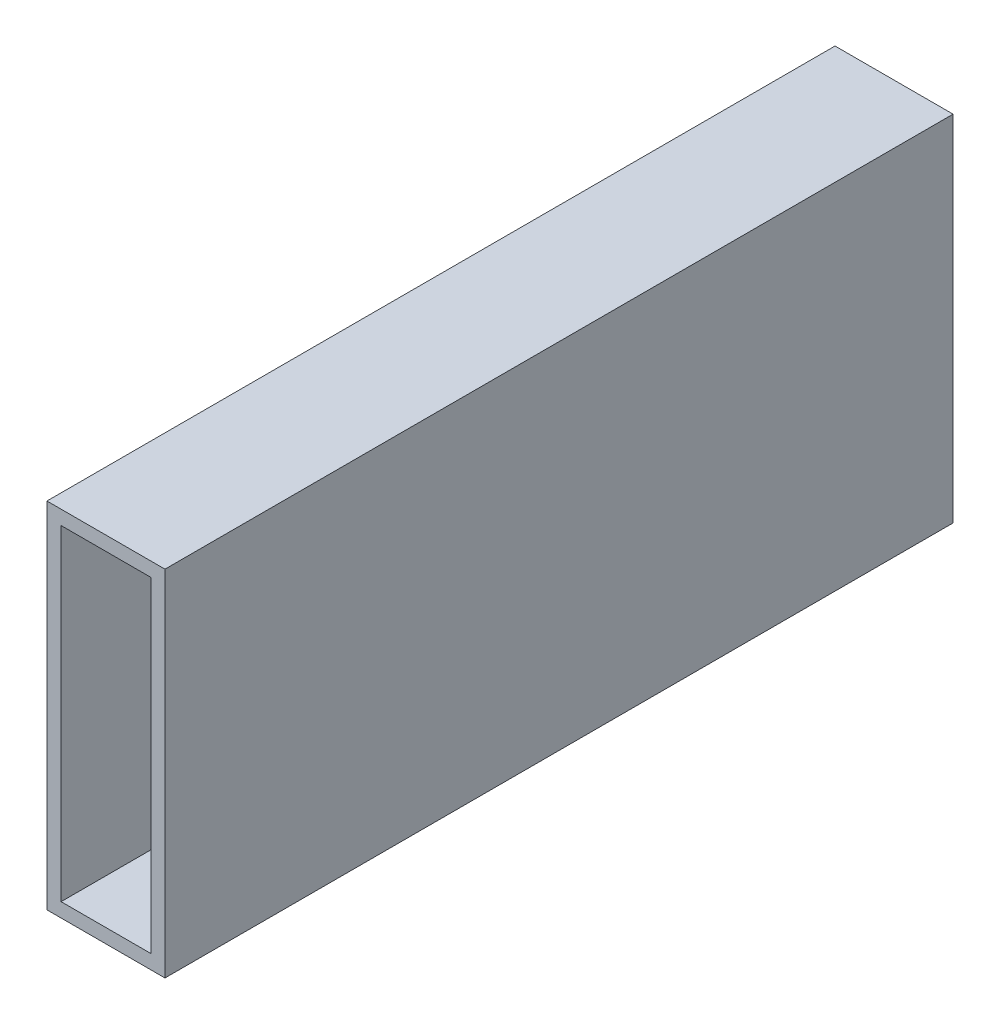
ISO-10303-21;
HEADER;
FILE_DESCRIPTION(('STEP AP214'),'2;1');
FILE_NAME('part.step','',(''),(''),'','','');
FILE_SCHEMA(('AUTOMOTIVE_DESIGN { 1 0 10303 214 1 1 1 1 }'));
ENDSEC;
DATA;
#1=APPLICATION_CONTEXT('core data for automotive mechanical design processes');
#2=APPLICATION_PROTOCOL_DEFINITION('international standard','automotive_design',2000,#1);
#3=PRODUCT_CONTEXT('',#1,'mechanical');
#4=PRODUCT('Part','Part','',(#3));
#5=PRODUCT_RELATED_PRODUCT_CATEGORY('part','',(#4));
#6=PRODUCT_DEFINITION_FORMATION('','',#4);
#7=PRODUCT_DEFINITION_CONTEXT('part definition',#1,'design');
#8=PRODUCT_DEFINITION('design','',#6,#7);
#9=PRODUCT_DEFINITION_SHAPE('','',#8);
#10=(LENGTH_UNIT() NAMED_UNIT(*) SI_UNIT(.MILLI.,.METRE.));
#11=(NAMED_UNIT(*) PLANE_ANGLE_UNIT() SI_UNIT($,.RADIAN.));
#12=(NAMED_UNIT(*) SI_UNIT($,.STERADIAN.) SOLID_ANGLE_UNIT());
#13=UNCERTAINTY_MEASURE_WITH_UNIT(LENGTH_MEASURE(1.E-05),#10,'distance_accuracy_value','');
#14=(GEOMETRIC_REPRESENTATION_CONTEXT(3) GLOBAL_UNCERTAINTY_ASSIGNED_CONTEXT((#13)) GLOBAL_UNIT_ASSIGNED_CONTEXT((#10,
#11,#12)) REPRESENTATION_CONTEXT('',''));
#15=CARTESIAN_POINT('',(0.,0.,0.));
#16=DIRECTION('',(0.,0.,1.));
#17=DIRECTION('',(1.,0.,0.));
#18=AXIS2_PLACEMENT_3D('',#15,#16,#17);
#19=CARTESIAN_POINT('',(0.,-38.1,195.));
#20=DIRECTION('',(0.,-1.,0.));
#21=DIRECTION('',(0.,0.,-1.));
#22=AXIS2_PLACEMENT_3D('',#19,#20,#21);
#23=PLANE('',#22);
#24=DIRECTION('',(1.,0.,0.));
#25=VECTOR('',#24,1.);
#26=CARTESIAN_POINT('',(12.7,-38.1000000000002,182.3));
#27=LINE('',#26,#25);
#28=CARTESIAN_POINT('',(-12.7,-38.1,182.3));
#29=VERTEX_POINT('',#28);
#30=CARTESIAN_POINT('',(12.7,-38.1000000000002,182.3));
#31=VERTEX_POINT('',#30);
#32=EDGE_CURVE('E110',#29,#31,#27,.T.);
#33=ORIENTED_EDGE('',*,*,#32,.F.);
#34=DIRECTION('',(0.,0.,-1.));
#35=VECTOR('',#34,1.);
#36=CARTESIAN_POINT('',(-12.7,-38.1,195.));
#37=LINE('',#36,#35);
#38=CARTESIAN_POINT('',(-12.7,-38.1000000000002,12.7000000000001));
#39=VERTEX_POINT('',#38);
#40=EDGE_CURVE('E118',#29,#39,#37,.T.);
#41=ORIENTED_EDGE('',*,*,#40,.T.);
#42=DIRECTION('',(1.,0.,0.));
#43=VECTOR('',#42,1.);
#44=CARTESIAN_POINT('',(12.7,-38.1000000000002,12.7000000000001));
#45=LINE('',#44,#43);
#46=CARTESIAN_POINT('',(12.7,-38.1,12.7000000000002));
#47=VERTEX_POINT('',#46);
#48=EDGE_CURVE('E119',#39,#47,#45,.T.);
#49=ORIENTED_EDGE('',*,*,#48,.T.);
#50=DIRECTION('',(0.,0.,-1.));
#51=VECTOR('',#50,1.);
#52=CARTESIAN_POINT('',(12.7,-38.1,195.));
#53=LINE('',#52,#51);
#54=EDGE_CURVE('E125',#31,#47,#53,.T.);
#55=ORIENTED_EDGE('',*,*,#54,.F.);
#56=EDGE_LOOP('',(#33,#41,#49,#55));
#57=FACE_BOUND('',#56,.T.);
#58=ADVANCED_FACE('F34',(#57),#23,.T.);
#59=CARTESIAN_POINT('',(-12.7,0.,195.));
#60=DIRECTION('',(-1.,0.,0.));
#61=DIRECTION('',(0.,0.,1.));
#62=AXIS2_PLACEMENT_3D('',#59,#60,#61);
#63=PLANE('',#62);
#64=DIRECTION('',(0.,1.,0.));
#65=VECTOR('',#64,1.);
#66=CARTESIAN_POINT('',(-12.7,0.,182.3));
#67=LINE('',#66,#65);
#68=CARTESIAN_POINT('',(-12.7,38.0999999999999,182.3));
#69=VERTEX_POINT('',#68);
#70=EDGE_CURVE('E103',#29,#69,#67,.T.);
#71=ORIENTED_EDGE('',*,*,#70,.T.);
#72=DIRECTION('',(0.,0.,-1.));
#73=VECTOR('',#72,1.);
#74=CARTESIAN_POINT('',(-12.7,38.1,195.));
#75=LINE('',#74,#73);
#76=CARTESIAN_POINT('',(-12.7,38.0999999999998,12.6999999999999));
#77=VERTEX_POINT('',#76);
#78=EDGE_CURVE('E43',#69,#77,#75,.T.);
#79=ORIENTED_EDGE('',*,*,#78,.T.);
#80=DIRECTION('',(0.,-1.,0.));
#81=VECTOR('',#80,1.);
#82=CARTESIAN_POINT('',(-12.7,0.,12.7000000000001));
#83=LINE('',#82,#81);
#84=EDGE_CURVE('E170',#77,#39,#83,.T.);
#85=ORIENTED_EDGE('',*,*,#84,.T.);
#86=ORIENTED_EDGE('',*,*,#40,.F.);
#87=EDGE_LOOP('',(#71,#79,#85,#86));
#88=FACE_BOUND('',#87,.T.);
#89=ADVANCED_FACE('F115',(#88),#63,.T.);
#90=CARTESIAN_POINT('',(0.,38.1,195.));
#91=DIRECTION('',(0.,1.,0.));
#92=DIRECTION('',(0.,0.,1.));
#93=AXIS2_PLACEMENT_3D('',#90,#91,#92);
#94=PLANE('',#93);
#95=DIRECTION('',(1.,0.,0.));
#96=VECTOR('',#95,1.);
#97=CARTESIAN_POINT('',(12.7,38.0999999999999,182.3));
#98=LINE('',#97,#96);
#99=CARTESIAN_POINT('',(12.7,38.0999999999999,182.3));
#100=VERTEX_POINT('',#99);
#101=EDGE_CURVE('E100',#69,#100,#98,.T.);
#102=ORIENTED_EDGE('',*,*,#101,.T.);
#103=DIRECTION('',(0.,0.,-1.));
#104=VECTOR('',#103,1.);
#105=CARTESIAN_POINT('',(12.7,38.1,195.));
#106=LINE('',#105,#104);
#107=CARTESIAN_POINT('',(12.7,38.0999999999998,12.6999999999999));
#108=VERTEX_POINT('',#107);
#109=EDGE_CURVE('E11',#100,#108,#106,.T.);
#110=ORIENTED_EDGE('',*,*,#109,.T.);
#111=DIRECTION('',(1.,0.,0.));
#112=VECTOR('',#111,1.);
#113=CARTESIAN_POINT('',(12.7,38.0999999999998,12.6999999999999));
#114=LINE('',#113,#112);
#115=EDGE_CURVE('E123',#77,#108,#114,.T.);
#116=ORIENTED_EDGE('',*,*,#115,.F.);
#117=ORIENTED_EDGE('',*,*,#78,.F.);
#118=EDGE_LOOP('',(#102,#110,#116,#117));
#119=FACE_BOUND('',#118,.T.);
#120=ADVANCED_FACE('F122',(#119),#94,.T.);
#121=CARTESIAN_POINT('',(12.7000000000001,0.,195.));
#122=DIRECTION('',(-1.,0.,0.));
#123=DIRECTION('',(0.,-1.,0.));
#124=AXIS2_PLACEMENT_3D('',#121,#122,#123);
#125=PLANE('',#124);
#126=ORIENTED_EDGE('',*,*,#109,.F.);
#127=DIRECTION('',(0.,-1.,0.));
#128=VECTOR('',#127,1.);
#129=CARTESIAN_POINT('',(12.7000000000001,0.,182.3));
#130=LINE('',#129,#128);
#131=EDGE_CURVE('E106',#100,#31,#130,.T.);
#132=ORIENTED_EDGE('',*,*,#131,.T.);
#133=ORIENTED_EDGE('',*,*,#54,.T.);
#134=DIRECTION('',(0.,1.,0.));
#135=VECTOR('',#134,1.);
#136=CARTESIAN_POINT('',(12.7000000000001,0.,12.7000000000001));
#137=LINE('',#136,#135);
#138=EDGE_CURVE('E158',#47,#108,#137,.T.);
#139=ORIENTED_EDGE('',*,*,#138,.T.);
#140=EDGE_LOOP('',(#126,#132,#133,#139));
#141=FACE_BOUND('',#140,.T.);
#142=ADVANCED_FACE('F173',(#141),#125,.F.);
#143=CARTESIAN_POINT('',(12.7,0.,12.7000000000001));
#144=DIRECTION('',(0.,0.,1.));
#145=DIRECTION('',(0.,-1.,0.));
#146=AXIS2_PLACEMENT_3D('',#143,#144,#145);
#147=PLANE('',#146);
#148=DIRECTION('',(1.,0.,0.));
#149=VECTOR('',#148,1.);
#150=CARTESIAN_POINT('',(0.,35.052,12.7000000000001));
#151=LINE('',#150,#149);
#152=CARTESIAN_POINT('',(-9.65199999999999,35.052,12.7000000000001));
#153=VERTEX_POINT('',#152);
#154=CARTESIAN_POINT('',(9.65199999999999,35.052,12.7000000000001));
#155=VERTEX_POINT('',#154);
#156=EDGE_CURVE('E165',#153,#155,#151,.T.);
#157=ORIENTED_EDGE('',*,*,#156,.F.);
#158=DIRECTION('',(0.,-1.,0.));
#159=VECTOR('',#158,1.);
#160=CARTESIAN_POINT('',(-9.65199999999999,0.,12.7000000000001));
#161=LINE('',#160,#159);
#162=CARTESIAN_POINT('',(-9.65199999999999,-35.052,12.7000000000001));
#163=VERTEX_POINT('',#162);
#164=EDGE_CURVE('E163',#153,#163,#161,.T.);
#165=ORIENTED_EDGE('',*,*,#164,.T.);
#166=DIRECTION('',(1.,0.,0.));
#167=VECTOR('',#166,1.);
#168=CARTESIAN_POINT('',(0.,-35.052,12.7000000000001));
#169=LINE('',#168,#167);
#170=CARTESIAN_POINT('',(9.652,-35.052,12.7000000000001));
#171=VERTEX_POINT('',#170);
#172=EDGE_CURVE('E161',#163,#171,#169,.T.);
#173=ORIENTED_EDGE('',*,*,#172,.T.);
#174=DIRECTION('',(0.,-1.,0.));
#175=VECTOR('',#174,1.);
#176=CARTESIAN_POINT('',(9.652,0.,12.7000000000001));
#177=LINE('',#176,#175);
#178=EDGE_CURVE('E59',#155,#171,#177,.T.);
#179=ORIENTED_EDGE('',*,*,#178,.F.);
#180=EDGE_LOOP('',(#157,#165,#173,#179));
#181=FACE_BOUND('',#180,.T.);
#182=ORIENTED_EDGE('',*,*,#48,.F.);
#183=ORIENTED_EDGE('',*,*,#84,.F.);
#184=ORIENTED_EDGE('',*,*,#115,.T.);
#185=ORIENTED_EDGE('',*,*,#138,.F.);
#186=EDGE_LOOP('',(#182,#183,#184,#185));
#187=FACE_BOUND('',#186,.T.);
#188=ADVANCED_FACE('F175',(#181,#187),#147,.F.);
#189=CARTESIAN_POINT('',(12.7,0.,182.3));
#190=DIRECTION('',(0.,0.,-1.));
#191=DIRECTION('',(-1.,0.,0.));
#192=AXIS2_PLACEMENT_3D('',#189,#190,#191);
#193=PLANE('',#192);
#194=DIRECTION('',(-1.,0.,0.));
#195=VECTOR('',#194,1.);
#196=CARTESIAN_POINT('',(0.,-35.052,182.3));
#197=LINE('',#196,#195);
#198=CARTESIAN_POINT('',(9.652,-35.052,182.3));
#199=VERTEX_POINT('',#198);
#200=CARTESIAN_POINT('',(-9.65199999999999,-35.052,182.3));
#201=VERTEX_POINT('',#200);
#202=EDGE_CURVE('E153',#199,#201,#197,.T.);
#203=ORIENTED_EDGE('',*,*,#202,.T.);
#204=DIRECTION('',(0.,1.,0.));
#205=VECTOR('',#204,1.);
#206=CARTESIAN_POINT('',(-9.65199999999999,0.,182.3));
#207=LINE('',#206,#205);
#208=CARTESIAN_POINT('',(-9.65199999999999,35.052,182.3));
#209=VERTEX_POINT('',#208);
#210=EDGE_CURVE('E51',#201,#209,#207,.T.);
#211=ORIENTED_EDGE('',*,*,#210,.T.);
#212=DIRECTION('',(-1.,0.,0.));
#213=VECTOR('',#212,1.);
#214=CARTESIAN_POINT('',(0.,35.052,182.3));
#215=LINE('',#214,#213);
#216=CARTESIAN_POINT('',(9.65199999999999,35.052,182.3));
#217=VERTEX_POINT('',#216);
#218=EDGE_CURVE('E156',#217,#209,#215,.T.);
#219=ORIENTED_EDGE('',*,*,#218,.F.);
#220=DIRECTION('',(0.,1.,0.));
#221=VECTOR('',#220,1.);
#222=CARTESIAN_POINT('',(9.652,0.,182.3));
#223=LINE('',#222,#221);
#224=EDGE_CURVE('E150',#199,#217,#223,.T.);
#225=ORIENTED_EDGE('',*,*,#224,.F.);
#226=EDGE_LOOP('',(#203,#211,#219,#225));
#227=FACE_BOUND('',#226,.T.);
#228=ORIENTED_EDGE('',*,*,#101,.F.);
#229=ORIENTED_EDGE('',*,*,#70,.F.);
#230=ORIENTED_EDGE('',*,*,#32,.T.);
#231=ORIENTED_EDGE('',*,*,#131,.F.);
#232=EDGE_LOOP('',(#228,#229,#230,#231));
#233=FACE_BOUND('',#232,.T.);
#234=ADVANCED_FACE('F102',(#227,#233),#193,.F.);
#235=CARTESIAN_POINT('',(9.652,0.,195.));
#236=DIRECTION('',(1.,0.,0.));
#237=DIRECTION('',(0.,1.,0.));
#238=AXIS2_PLACEMENT_3D('',#235,#236,#237);
#239=PLANE('',#238);
#240=DIRECTION('',(0.,0.,-1.));
#241=VECTOR('',#240,1.);
#242=CARTESIAN_POINT('',(9.652,-35.052,195.));
#243=LINE('',#242,#241);
#244=EDGE_CURVE('E38',#199,#171,#243,.T.);
#245=ORIENTED_EDGE('',*,*,#244,.F.);
#246=ORIENTED_EDGE('',*,*,#224,.T.);
#247=DIRECTION('',(0.,0.,-1.));
#248=VECTOR('',#247,1.);
#249=CARTESIAN_POINT('',(9.65199999999999,35.052,195.));
#250=LINE('',#249,#248);
#251=EDGE_CURVE('E129',#217,#155,#250,.T.);
#252=ORIENTED_EDGE('',*,*,#251,.T.);
#253=ORIENTED_EDGE('',*,*,#178,.T.);
#254=EDGE_LOOP('',(#245,#246,#252,#253));
#255=FACE_BOUND('',#254,.T.);
#256=ADVANCED_FACE('F36',(#255),#239,.F.);
#257=CARTESIAN_POINT('',(0.,-35.052,195.));
#258=DIRECTION('',(0.,1.,0.));
#259=DIRECTION('',(-1.,0.,0.));
#260=AXIS2_PLACEMENT_3D('',#257,#258,#259);
#261=PLANE('',#260);
#262=ORIENTED_EDGE('',*,*,#202,.F.);
#263=ORIENTED_EDGE('',*,*,#244,.T.);
#264=ORIENTED_EDGE('',*,*,#172,.F.);
#265=DIRECTION('',(0.,0.,-1.));
#266=VECTOR('',#265,1.);
#267=CARTESIAN_POINT('',(-9.65199999999999,-35.052,195.));
#268=LINE('',#267,#266);
#269=EDGE_CURVE('E134',#201,#163,#268,.T.);
#270=ORIENTED_EDGE('',*,*,#269,.F.);
#271=EDGE_LOOP('',(#262,#263,#264,#270));
#272=FACE_BOUND('',#271,.T.);
#273=ADVANCED_FACE('F199',(#272),#261,.T.);
#274=CARTESIAN_POINT('',(-9.65199999999999,0.,195.));
#275=DIRECTION('',(1.,0.,0.));
#276=DIRECTION('',(0.,1.,0.));
#277=AXIS2_PLACEMENT_3D('',#274,#275,#276);
#278=PLANE('',#277);
#279=ORIENTED_EDGE('',*,*,#210,.F.);
#280=ORIENTED_EDGE('',*,*,#269,.T.);
#281=ORIENTED_EDGE('',*,*,#164,.F.);
#282=DIRECTION('',(0.,0.,-1.));
#283=VECTOR('',#282,1.);
#284=CARTESIAN_POINT('',(-9.65199999999999,35.052,195.));
#285=LINE('',#284,#283);
#286=EDGE_CURVE('E132',#209,#153,#285,.T.);
#287=ORIENTED_EDGE('',*,*,#286,.F.);
#288=EDGE_LOOP('',(#279,#280,#281,#287));
#289=FACE_BOUND('',#288,.T.);
#290=ADVANCED_FACE('F196',(#289),#278,.T.);
#291=CARTESIAN_POINT('',(0.,35.052,195.));
#292=DIRECTION('',(0.,1.,0.));
#293=DIRECTION('',(0.,0.,1.));
#294=AXIS2_PLACEMENT_3D('',#291,#292,#293);
#295=PLANE('',#294);
#296=ORIENTED_EDGE('',*,*,#251,.F.);
#297=ORIENTED_EDGE('',*,*,#218,.T.);
#298=ORIENTED_EDGE('',*,*,#286,.T.);
#299=ORIENTED_EDGE('',*,*,#156,.T.);
#300=EDGE_LOOP('',(#296,#297,#298,#299));
#301=FACE_BOUND('',#300,.T.);
#302=ADVANCED_FACE('F193',(#301),#295,.F.);
#303=CLOSED_SHELL('',(#58,#89,#120,#142,#188,#234,#256,#273,#290,#302));
#304=MANIFOLD_SOLID_BREP('B2',#303);
#305=ADVANCED_BREP_SHAPE_REPRESENTATION('',(#18,#304),#14);
#306=SHAPE_DEFINITION_REPRESENTATION(#9,#305);
ENDSEC;
END-ISO-10303-21;
